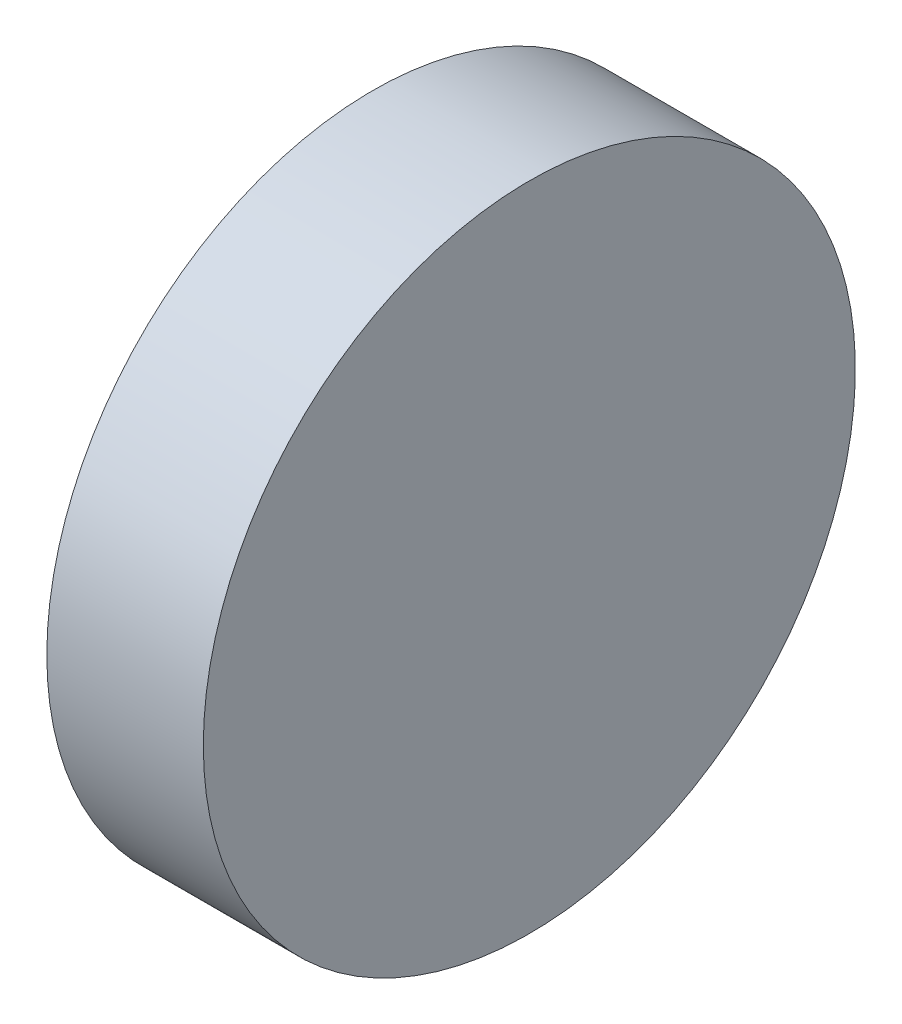
ISO-10303-21;
HEADER;
FILE_DESCRIPTION(('STEP AP214'),'2;1');
FILE_NAME('part.step','',(''),(''),'','','');
FILE_SCHEMA(('AUTOMOTIVE_DESIGN { 1 0 10303 214 1 1 1 1 }'));
ENDSEC;
DATA;
#1=APPLICATION_CONTEXT('core data for automotive mechanical design processes');
#2=APPLICATION_PROTOCOL_DEFINITION('international standard','automotive_design',2000,#1);
#3=PRODUCT_CONTEXT('',#1,'mechanical');
#4=PRODUCT('Part','Part','',(#3));
#5=PRODUCT_RELATED_PRODUCT_CATEGORY('part','',(#4));
#6=PRODUCT_DEFINITION_FORMATION('','',#4);
#7=PRODUCT_DEFINITION_CONTEXT('part definition',#1,'design');
#8=PRODUCT_DEFINITION('design','',#6,#7);
#9=PRODUCT_DEFINITION_SHAPE('','',#8);
#10=(LENGTH_UNIT() NAMED_UNIT(*) SI_UNIT(.MILLI.,.METRE.));
#11=(NAMED_UNIT(*) PLANE_ANGLE_UNIT() SI_UNIT($,.RADIAN.));
#12=(NAMED_UNIT(*) SI_UNIT($,.STERADIAN.) SOLID_ANGLE_UNIT());
#13=UNCERTAINTY_MEASURE_WITH_UNIT(LENGTH_MEASURE(1.E-05),#10,'distance_accuracy_value','');
#14=(GEOMETRIC_REPRESENTATION_CONTEXT(3) GLOBAL_UNCERTAINTY_ASSIGNED_CONTEXT((#13)) GLOBAL_UNIT_ASSIGNED_CONTEXT((#10,
#11,#12)) REPRESENTATION_CONTEXT('',''));
#15=CARTESIAN_POINT('',(0.,0.,0.));
#16=DIRECTION('',(0.,0.,1.));
#17=DIRECTION('',(1.,0.,0.));
#18=AXIS2_PLACEMENT_3D('',#15,#16,#17);
#19=CARTESIAN_POINT('',(266.286208168476,77.2931793490154,0.));
#20=DIRECTION('',(-1.,0.,0.));
#21=DIRECTION('',(0.,0.,1.));
#22=AXIS2_PLACEMENT_3D('',#19,#20,#21);
#23=PLANE('',#22);
#24=CARTESIAN_POINT('',(266.286208168476,77.2931793490154,0.));
#25=DIRECTION('',(-1.,0.,0.));
#26=DIRECTION('',(0.,0.,1.));
#27=AXIS2_PLACEMENT_3D('',#24,#25,#26);
#28=CIRCLE('',#27,12.5);
#29=CARTESIAN_POINT('',(266.286208168476,77.2931793490154,12.5));
#30=VERTEX_POINT('',#29);
#31=EDGE_CURVE('E10',#30,#30,#28,.T.);
#32=ORIENTED_EDGE('',*,*,#31,.F.);
#33=EDGE_LOOP('',(#32));
#34=FACE_BOUND('',#33,.T.);
#35=ADVANCED_FACE('F35',(#34),#23,.F.);
#36=CARTESIAN_POINT('',(254.000801992616,77.2931793490154,0.));
#37=DIRECTION('',(-1.,0.,0.));
#38=DIRECTION('',(0.,0.,1.));
#39=AXIS2_PLACEMENT_3D('',#36,#37,#38);
#40=CYLINDRICAL_SURFACE('',#39,12.5);
#41=CARTESIAN_POINT('',(260.286208168476,77.2931793490154,0.));
#42=DIRECTION('',(-1.,0.,0.));
#43=DIRECTION('',(0.,0.,1.));
#44=AXIS2_PLACEMENT_3D('',#41,#42,#43);
#45=CIRCLE('',#44,12.5);
#46=CARTESIAN_POINT('',(260.286208168476,77.2931793490154,12.5));
#47=VERTEX_POINT('',#46);
#48=EDGE_CURVE('E41',#47,#47,#45,.T.);
#49=ORIENTED_EDGE('',*,*,#48,.F.);
#50=EDGE_LOOP('',(#49));
#51=FACE_BOUND('',#50,.T.);
#52=ORIENTED_EDGE('',*,*,#31,.T.);
#53=EDGE_LOOP('',(#52));
#54=FACE_BOUND('',#53,.T.);
#55=ADVANCED_FACE('F49',(#51,#54),#40,.T.);
#56=CARTESIAN_POINT('',(260.286208168476,77.2931793490154,0.));
#57=DIRECTION('',(1.,0.,0.));
#58=DIRECTION('',(0.,0.,-1.));
#59=AXIS2_PLACEMENT_3D('',#56,#57,#58);
#60=PLANE('',#59);
#61=ORIENTED_EDGE('',*,*,#48,.T.);
#62=EDGE_LOOP('',(#61));
#63=FACE_BOUND('',#62,.T.);
#64=ADVANCED_FACE('F47',(#63),#60,.F.);
#65=CLOSED_SHELL('',(#35,#55,#64));
#66=MANIFOLD_SOLID_BREP('B2',#65);
#67=ADVANCED_BREP_SHAPE_REPRESENTATION('',(#18,#66),#14);
#68=SHAPE_DEFINITION_REPRESENTATION(#9,#67);
ENDSEC;
END-ISO-10303-21;
